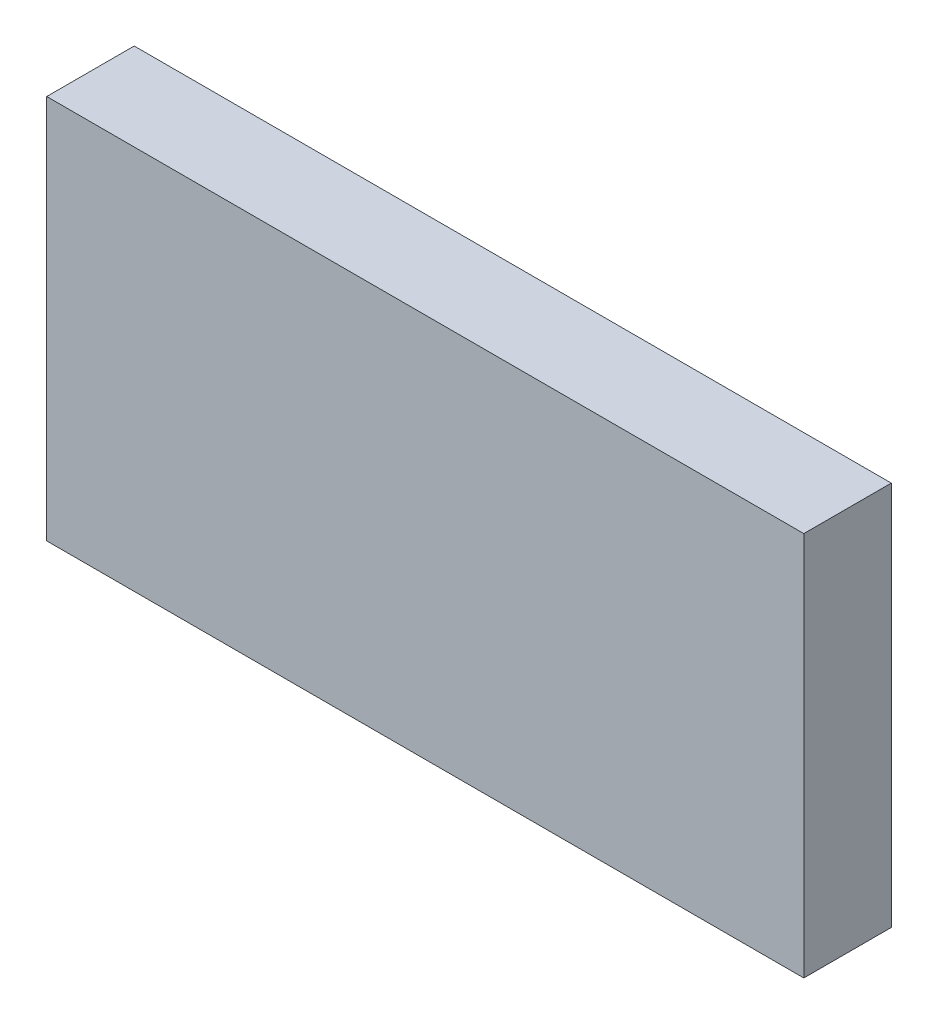
ISO-10303-21;
HEADER;
FILE_DESCRIPTION(('STEP AP214'),'2;1');
FILE_NAME('part.step','',(''),(''),'','','');
FILE_SCHEMA(('AUTOMOTIVE_DESIGN { 1 0 10303 214 1 1 1 1 }'));
ENDSEC;
DATA;
#1=APPLICATION_CONTEXT('core data for automotive mechanical design processes');
#2=APPLICATION_PROTOCOL_DEFINITION('international standard','automotive_design',2000,#1);
#3=PRODUCT_CONTEXT('',#1,'mechanical');
#4=PRODUCT('Part','Part','',(#3));
#5=PRODUCT_RELATED_PRODUCT_CATEGORY('part','',(#4));
#6=PRODUCT_DEFINITION_FORMATION('','',#4);
#7=PRODUCT_DEFINITION_CONTEXT('part definition',#1,'design');
#8=PRODUCT_DEFINITION('design','',#6,#7);
#9=PRODUCT_DEFINITION_SHAPE('','',#8);
#10=(LENGTH_UNIT() NAMED_UNIT(*) SI_UNIT(.MILLI.,.METRE.));
#11=(NAMED_UNIT(*) PLANE_ANGLE_UNIT() SI_UNIT($,.RADIAN.));
#12=(NAMED_UNIT(*) SI_UNIT($,.STERADIAN.) SOLID_ANGLE_UNIT());
#13=UNCERTAINTY_MEASURE_WITH_UNIT(LENGTH_MEASURE(1.E-05),#10,'distance_accuracy_value','');
#14=(GEOMETRIC_REPRESENTATION_CONTEXT(3) GLOBAL_UNCERTAINTY_ASSIGNED_CONTEXT((#13)) GLOBAL_UNIT_ASSIGNED_CONTEXT((#10,
#11,#12)) REPRESENTATION_CONTEXT('',''));
#15=CARTESIAN_POINT('',(0.,0.,0.));
#16=DIRECTION('',(0.,0.,1.));
#17=DIRECTION('',(1.,0.,0.));
#18=AXIS2_PLACEMENT_3D('',#15,#16,#17);
#19=CARTESIAN_POINT('',(-1.445,-1.42,0.));
#20=DIRECTION('',(1.,0.,0.));
#21=DIRECTION('',(0.,0.,1.));
#22=AXIS2_PLACEMENT_3D('',#19,#20,#21);
#23=PLANE('',#22);
#24=DIRECTION('',(0.,1.,0.));
#25=VECTOR('',#24,1.);
#26=CARTESIAN_POINT('',(-1.445,-1.42,0.1));
#27=LINE('',#26,#25);
#28=CARTESIAN_POINT('',(-1.445,-1.42,0.1));
#29=VERTEX_POINT('',#28);
#30=CARTESIAN_POINT('',(-1.445,-0.98,0.1));
#31=VERTEX_POINT('',#30);
#32=EDGE_CURVE('E11',#29,#31,#27,.T.);
#33=ORIENTED_EDGE('',*,*,#32,.T.);
#34=DIRECTION('',(0.,0.,1.));
#35=VECTOR('',#34,1.);
#36=CARTESIAN_POINT('',(-1.445,-0.98,0.));
#37=LINE('',#36,#35);
#38=CARTESIAN_POINT('',(-1.445,-0.98,0.));
#39=VERTEX_POINT('',#38);
#40=EDGE_CURVE('E24',#39,#31,#37,.T.);
#41=ORIENTED_EDGE('',*,*,#40,.F.);
#42=DIRECTION('',(0.,1.,0.));
#43=VECTOR('',#42,1.);
#44=CARTESIAN_POINT('',(-1.445,-1.42,0.));
#45=LINE('',#44,#43);
#46=CARTESIAN_POINT('',(-1.445,-1.42,0.));
#47=VERTEX_POINT('',#46);
#48=EDGE_CURVE('E86',#47,#39,#45,.T.);
#49=ORIENTED_EDGE('',*,*,#48,.F.);
#50=DIRECTION('',(0.,0.,1.));
#51=VECTOR('',#50,1.);
#52=CARTESIAN_POINT('',(-1.445,-1.42,0.));
#53=LINE('',#52,#51);
#54=EDGE_CURVE('E36',#47,#29,#53,.T.);
#55=ORIENTED_EDGE('',*,*,#54,.T.);
#56=EDGE_LOOP('',(#33,#41,#49,#55));
#57=FACE_BOUND('',#56,.T.);
#58=ADVANCED_FACE('F17',(#57),#23,.F.);
#59=CARTESIAN_POINT('',(-0.5795,-1.42,0.));
#60=DIRECTION('',(1.,0.,0.));
#61=DIRECTION('',(0.,0.,1.));
#62=AXIS2_PLACEMENT_3D('',#59,#60,#61);
#63=PLANE('',#62);
#64=DIRECTION('',(0.,0.,1.));
#65=VECTOR('',#64,1.);
#66=CARTESIAN_POINT('',(-0.5795,-1.42,0.));
#67=LINE('',#66,#65);
#68=CARTESIAN_POINT('',(-0.5795,-1.42,0.));
#69=VERTEX_POINT('',#68);
#70=CARTESIAN_POINT('',(-0.5795,-1.42,0.1));
#71=VERTEX_POINT('',#70);
#72=EDGE_CURVE('E83',#69,#71,#67,.T.);
#73=ORIENTED_EDGE('',*,*,#72,.F.);
#74=DIRECTION('',(0.,1.,0.));
#75=VECTOR('',#74,1.);
#76=CARTESIAN_POINT('',(-0.5795,-1.42,0.));
#77=LINE('',#76,#75);
#78=CARTESIAN_POINT('',(-0.5795,-0.98,0.));
#79=VERTEX_POINT('',#78);
#80=EDGE_CURVE('E63',#69,#79,#77,.T.);
#81=ORIENTED_EDGE('',*,*,#80,.T.);
#82=DIRECTION('',(0.,0.,1.));
#83=VECTOR('',#82,1.);
#84=CARTESIAN_POINT('',(-0.5795,-0.98,0.));
#85=LINE('',#84,#83);
#86=CARTESIAN_POINT('',(-0.5795,-0.98,0.1));
#87=VERTEX_POINT('',#86);
#88=EDGE_CURVE('E57',#79,#87,#85,.T.);
#89=ORIENTED_EDGE('',*,*,#88,.T.);
#90=DIRECTION('',(0.,1.,0.));
#91=VECTOR('',#90,1.);
#92=CARTESIAN_POINT('',(-0.5795,-1.42,0.1));
#93=LINE('',#92,#91);
#94=EDGE_CURVE('E60',#71,#87,#93,.T.);
#95=ORIENTED_EDGE('',*,*,#94,.F.);
#96=EDGE_LOOP('',(#73,#81,#89,#95));
#97=FACE_BOUND('',#96,.T.);
#98=ADVANCED_FACE('F59',(#97),#63,.T.);
#99=CARTESIAN_POINT('',(-1.445,-1.42,0.));
#100=DIRECTION('',(0.,1.,0.));
#101=DIRECTION('',(0.,0.,1.));
#102=AXIS2_PLACEMENT_3D('',#99,#100,#101);
#103=PLANE('',#102);
#104=ORIENTED_EDGE('',*,*,#72,.T.);
#105=DIRECTION('',(1.,0.,0.));
#106=VECTOR('',#105,1.);
#107=CARTESIAN_POINT('',(-1.445,-1.42,0.1));
#108=LINE('',#107,#106);
#109=EDGE_CURVE('E71',#29,#71,#108,.T.);
#110=ORIENTED_EDGE('',*,*,#109,.F.);
#111=ORIENTED_EDGE('',*,*,#54,.F.);
#112=DIRECTION('',(1.,0.,0.));
#113=VECTOR('',#112,1.);
#114=CARTESIAN_POINT('',(-1.445,-1.42,0.));
#115=LINE('',#114,#113);
#116=EDGE_CURVE('E76',#47,#69,#115,.T.);
#117=ORIENTED_EDGE('',*,*,#116,.T.);
#118=EDGE_LOOP('',(#104,#110,#111,#117));
#119=FACE_BOUND('',#118,.T.);
#120=ADVANCED_FACE('F91',(#119),#103,.F.);
#121=CARTESIAN_POINT('',(-1.445,-0.98,0.));
#122=DIRECTION('',(0.,1.,0.));
#123=DIRECTION('',(0.,0.,1.));
#124=AXIS2_PLACEMENT_3D('',#121,#122,#123);
#125=PLANE('',#124);
#126=DIRECTION('',(1.,0.,0.));
#127=VECTOR('',#126,1.);
#128=CARTESIAN_POINT('',(-1.445,-0.98,0.));
#129=LINE('',#128,#127);
#130=EDGE_CURVE('E74',#39,#79,#129,.T.);
#131=ORIENTED_EDGE('',*,*,#130,.F.);
#132=ORIENTED_EDGE('',*,*,#40,.T.);
#133=DIRECTION('',(1.,0.,0.));
#134=VECTOR('',#133,1.);
#135=CARTESIAN_POINT('',(-1.445,-0.98,0.1));
#136=LINE('',#135,#134);
#137=EDGE_CURVE('E69',#31,#87,#136,.T.);
#138=ORIENTED_EDGE('',*,*,#137,.T.);
#139=ORIENTED_EDGE('',*,*,#88,.F.);
#140=EDGE_LOOP('',(#131,#132,#138,#139));
#141=FACE_BOUND('',#140,.T.);
#142=ADVANCED_FACE('F73',(#141),#125,.T.);
#143=CARTESIAN_POINT('',(-1.445,-1.42,0.));
#144=DIRECTION('',(0.,0.,1.));
#145=DIRECTION('',(1.,0.,0.));
#146=AXIS2_PLACEMENT_3D('',#143,#144,#145);
#147=PLANE('',#146);
#148=ORIENTED_EDGE('',*,*,#130,.T.);
#149=ORIENTED_EDGE('',*,*,#80,.F.);
#150=ORIENTED_EDGE('',*,*,#116,.F.);
#151=ORIENTED_EDGE('',*,*,#48,.T.);
#152=EDGE_LOOP('',(#148,#149,#150,#151));
#153=FACE_BOUND('',#152,.T.);
#154=ADVANCED_FACE('F89',(#153),#147,.F.);
#155=CARTESIAN_POINT('',(-1.445,-1.42,0.1));
#156=DIRECTION('',(0.,0.,1.));
#157=DIRECTION('',(1.,0.,0.));
#158=AXIS2_PLACEMENT_3D('',#155,#156,#157);
#159=PLANE('',#158);
#160=ORIENTED_EDGE('',*,*,#32,.F.);
#161=ORIENTED_EDGE('',*,*,#109,.T.);
#162=ORIENTED_EDGE('',*,*,#94,.T.);
#163=ORIENTED_EDGE('',*,*,#137,.F.);
#164=EDGE_LOOP('',(#160,#161,#162,#163));
#165=FACE_BOUND('',#164,.T.);
#166=ADVANCED_FACE('F68',(#165),#159,.T.);
#167=CLOSED_SHELL('',(#58,#98,#120,#142,#154,#166));
#168=MANIFOLD_SOLID_BREP('B1',#167);
#169=ADVANCED_BREP_SHAPE_REPRESENTATION('',(#18,#168),#14);
#170=SHAPE_DEFINITION_REPRESENTATION(#9,#169);
ENDSEC;
END-ISO-10303-21;
